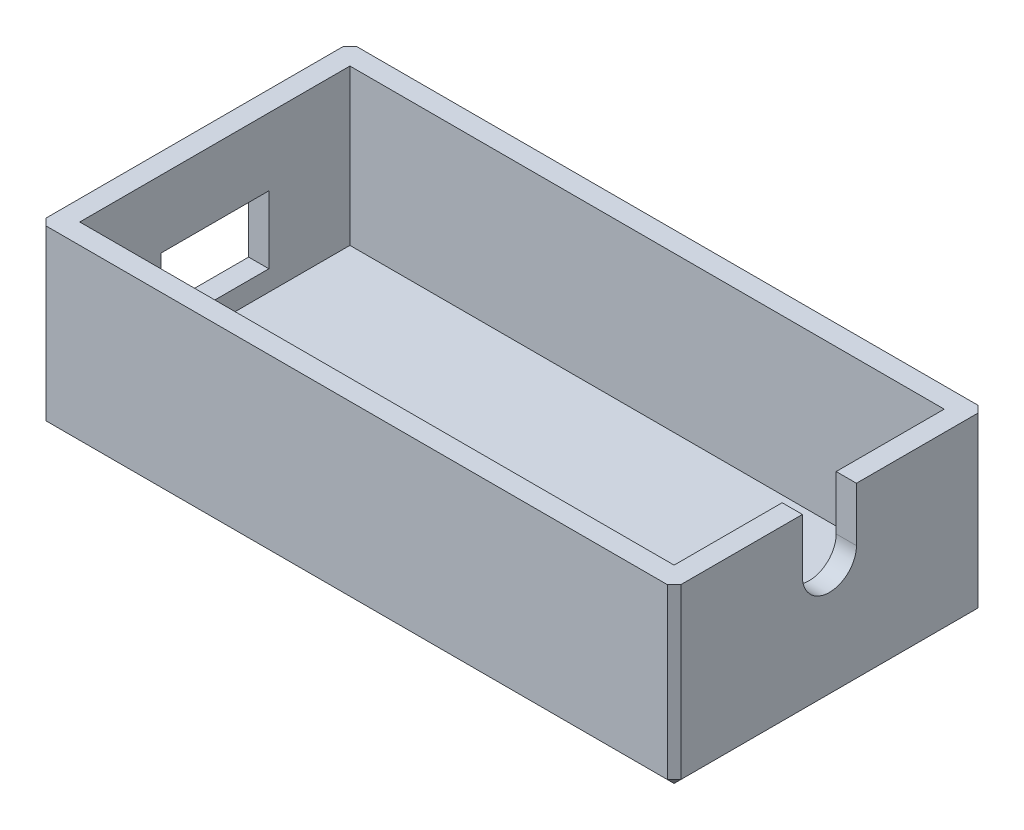
ISO-10303-21;
HEADER;
FILE_DESCRIPTION(('STEP AP214'),'2;1');
FILE_NAME('part.step','',(''),(''),'','','');
FILE_SCHEMA(('AUTOMOTIVE_DESIGN { 1 0 10303 214 1 1 1 1 }'));
ENDSEC;
DATA;
#1=APPLICATION_CONTEXT('core data for automotive mechanical design processes');
#2=APPLICATION_PROTOCOL_DEFINITION('international standard','automotive_design',2000,#1);
#3=PRODUCT_CONTEXT('',#1,'mechanical');
#4=PRODUCT('Part','Part','',(#3));
#5=PRODUCT_RELATED_PRODUCT_CATEGORY('part','',(#4));
#6=PRODUCT_DEFINITION_FORMATION('','',#4);
#7=PRODUCT_DEFINITION_CONTEXT('part definition',#1,'design');
#8=PRODUCT_DEFINITION('design','',#6,#7);
#9=PRODUCT_DEFINITION_SHAPE('','',#8);
#10=(LENGTH_UNIT() NAMED_UNIT(*) SI_UNIT(.MILLI.,.METRE.));
#11=(NAMED_UNIT(*) PLANE_ANGLE_UNIT() SI_UNIT($,.RADIAN.));
#12=(NAMED_UNIT(*) SI_UNIT($,.STERADIAN.) SOLID_ANGLE_UNIT());
#13=UNCERTAINTY_MEASURE_WITH_UNIT(LENGTH_MEASURE(1.E-05),#10,'distance_accuracy_value','');
#14=(GEOMETRIC_REPRESENTATION_CONTEXT(3) GLOBAL_UNCERTAINTY_ASSIGNED_CONTEXT((#13)) GLOBAL_UNIT_ASSIGNED_CONTEXT((#10,
#11,#12)) REPRESENTATION_CONTEXT('',''));
#15=CARTESIAN_POINT('',(0.,0.,0.));
#16=DIRECTION('',(0.,0.,1.));
#17=DIRECTION('',(1.,0.,0.));
#18=AXIS2_PLACEMENT_3D('',#15,#16,#17);
#19=CARTESIAN_POINT('',(24.,13.,0.));
#20=DIRECTION('',(1.,0.,0.));
#21=DIRECTION('',(0.,0.,-1.));
#22=AXIS2_PLACEMENT_3D('',#19,#20,#21);
#23=PLANE('',#22);
#24=DIRECTION('',(0.,0.,1.));
#25=VECTOR('',#24,1.);
#26=CARTESIAN_POINT('',(24.,13.,0.));
#27=LINE('',#26,#25);
#28=CARTESIAN_POINT('',(24.,13.,5.2911227154047));
#29=VERTEX_POINT('',#28);
#30=CARTESIAN_POINT('',(24.,13.,14.2911227154047));
#31=VERTEX_POINT('',#30);
#32=EDGE_CURVE('E215',#29,#31,#27,.T.);
#33=ORIENTED_EDGE('',*,*,#32,.T.);
#34=DIRECTION('',(0.,-1.,0.));
#35=VECTOR('',#34,1.);
#36=CARTESIAN_POINT('',(24.,0.,14.2911227154047));
#37=LINE('',#36,#35);
#38=CARTESIAN_POINT('',(24.,0.5,14.2911227154047));
#39=VERTEX_POINT('',#38);
#40=EDGE_CURVE('E311',#31,#39,#37,.T.);
#41=ORIENTED_EDGE('',*,*,#40,.T.);
#42=DIRECTION('',(0.,0.,-1.));
#43=VECTOR('',#42,1.);
#44=CARTESIAN_POINT('',(24.,0.5,-8.2088772845953));
#45=LINE('',#44,#43);
#46=CARTESIAN_POINT('',(24.,0.5,-7.7088772845953));
#47=VERTEX_POINT('',#46);
#48=EDGE_CURVE('E305',#39,#47,#45,.T.);
#49=ORIENTED_EDGE('',*,*,#48,.T.);
#50=DIRECTION('',(0.,1.,0.));
#51=VECTOR('',#50,1.);
#52=CARTESIAN_POINT('',(24.,13.,-7.7088772845953));
#53=LINE('',#52,#51);
#54=CARTESIAN_POINT('',(24.,13.,-7.7088772845953));
#55=VERTEX_POINT('',#54);
#56=EDGE_CURVE('E308',#47,#55,#53,.T.);
#57=ORIENTED_EDGE('',*,*,#56,.T.);
#58=CARTESIAN_POINT('',(24.,13.,1.2911227154047));
#59=VERTEX_POINT('',#58);
#60=EDGE_CURVE('E250',#55,#59,#27,.T.);
#61=ORIENTED_EDGE('',*,*,#60,.T.);
#62=DIRECTION('',(0.,1.,0.));
#63=VECTOR('',#62,1.);
#64=CARTESIAN_POINT('',(24.,13.,1.2911227154047));
#65=LINE('',#64,#63);
#66=CARTESIAN_POINT('',(24.,9.,1.2911227154047));
#67=VERTEX_POINT('',#66);
#68=EDGE_CURVE('E387',#67,#59,#65,.T.);
#69=ORIENTED_EDGE('',*,*,#68,.F.);
#70=CARTESIAN_POINT('',(24.,9.,3.2911227154047));
#71=DIRECTION('',(1.,0.,0.));
#72=DIRECTION('',(0.,0.,-1.));
#73=AXIS2_PLACEMENT_3D('',#70,#71,#72);
#74=CIRCLE('',#73,2.);
#75=CARTESIAN_POINT('',(24.,9.,5.2911227154047));
#76=VERTEX_POINT('',#75);
#77=EDGE_CURVE('E391',#76,#67,#74,.T.);
#78=ORIENTED_EDGE('',*,*,#77,.F.);
#79=DIRECTION('',(0.,1.,0.));
#80=VECTOR('',#79,1.);
#81=CARTESIAN_POINT('',(24.,13.,5.2911227154047));
#82=LINE('',#81,#80);
#83=EDGE_CURVE('E380',#76,#29,#82,.T.);
#84=ORIENTED_EDGE('',*,*,#83,.T.);
#85=EDGE_LOOP('',(#33,#41,#49,#57,#61,#69,#78,#84));
#86=FACE_BOUND('',#85,.T.);
#87=ADVANCED_FACE('F43',(#86),#23,.T.);
#88=CARTESIAN_POINT('',(0.,13.,-8.2088772845953));
#89=DIRECTION('',(0.,0.,-1.));
#90=DIRECTION('',(-1.,0.,0.));
#91=AXIS2_PLACEMENT_3D('',#88,#89,#90);
#92=PLANE('',#91);
#93=DIRECTION('',(-1.,0.,0.));
#94=VECTOR('',#93,1.);
#95=CARTESIAN_POINT('',(-23.,0.5,-8.2088772845953));
#96=LINE('',#95,#94);
#97=CARTESIAN_POINT('',(23.5,0.5,-8.2088772845953));
#98=VERTEX_POINT('',#97);
#99=CARTESIAN_POINT('',(-22.5,0.5,-8.2088772845953));
#100=VERTEX_POINT('',#99);
#101=EDGE_CURVE('E275',#98,#100,#96,.T.);
#102=ORIENTED_EDGE('',*,*,#101,.T.);
#103=DIRECTION('',(0.,1.,0.));
#104=VECTOR('',#103,1.);
#105=CARTESIAN_POINT('',(-22.5,13.,-8.2088772845953));
#106=LINE('',#105,#104);
#107=CARTESIAN_POINT('',(-22.5,13.,-8.2088772845953));
#108=VERTEX_POINT('',#107);
#109=EDGE_CURVE('E281',#100,#108,#106,.T.);
#110=ORIENTED_EDGE('',*,*,#109,.T.);
#111=DIRECTION('',(1.,0.,0.));
#112=VECTOR('',#111,1.);
#113=CARTESIAN_POINT('',(0.,13.,-8.2088772845953));
#114=LINE('',#113,#112);
#115=CARTESIAN_POINT('',(23.5,13.,-8.2088772845953));
#116=VERTEX_POINT('',#115);
#117=EDGE_CURVE('E253',#108,#116,#114,.T.);
#118=ORIENTED_EDGE('',*,*,#117,.T.);
#119=DIRECTION('',(0.,-1.,0.));
#120=VECTOR('',#119,1.);
#121=CARTESIAN_POINT('',(23.5,13.,-8.2088772845953));
#122=LINE('',#121,#120);
#123=EDGE_CURVE('E278',#116,#98,#122,.T.);
#124=ORIENTED_EDGE('',*,*,#123,.T.);
#125=EDGE_LOOP('',(#102,#110,#118,#124));
#126=FACE_BOUND('',#125,.T.);
#127=ADVANCED_FACE('F484',(#126),#92,.T.);
#128=CARTESIAN_POINT('',(-23.,13.,0.));
#129=DIRECTION('',(1.,0.,0.));
#130=DIRECTION('',(0.,0.,-1.));
#131=AXIS2_PLACEMENT_3D('',#128,#129,#130);
#132=PLANE('',#131);
#133=DIRECTION('',(0.,0.,1.));
#134=VECTOR('',#133,1.);
#135=CARTESIAN_POINT('',(-23.,13.,0.));
#136=LINE('',#135,#134);
#137=CARTESIAN_POINT('',(-23.,13.,-7.7088772845953));
#138=VERTEX_POINT('',#137);
#139=CARTESIAN_POINT('',(-23.,13.,14.2911227154047));
#140=VERTEX_POINT('',#139);
#141=EDGE_CURVE('E257',#138,#140,#136,.T.);
#142=ORIENTED_EDGE('',*,*,#141,.F.);
#143=DIRECTION('',(0.,-1.,0.));
#144=VECTOR('',#143,1.);
#145=CARTESIAN_POINT('',(-23.,0.,-7.7088772845953));
#146=LINE('',#145,#144);
#147=CARTESIAN_POINT('',(-23.,0.5,-7.7088772845953));
#148=VERTEX_POINT('',#147);
#149=EDGE_CURVE('E271',#138,#148,#146,.T.);
#150=ORIENTED_EDGE('',*,*,#149,.T.);
#151=DIRECTION('',(0.,0.,1.));
#152=VECTOR('',#151,1.);
#153=CARTESIAN_POINT('',(-23.,0.5,0.));
#154=LINE('',#153,#152);
#155=CARTESIAN_POINT('',(-23.,0.5,14.2911227154047));
#156=VERTEX_POINT('',#155);
#157=EDGE_CURVE('E265',#148,#156,#154,.T.);
#158=ORIENTED_EDGE('',*,*,#157,.T.);
#159=DIRECTION('',(0.,1.,0.));
#160=VECTOR('',#159,1.);
#161=CARTESIAN_POINT('',(-23.,13.,14.2911227154047));
#162=LINE('',#161,#160);
#163=EDGE_CURVE('E268',#156,#140,#162,.T.);
#164=ORIENTED_EDGE('',*,*,#163,.T.);
#165=EDGE_LOOP('',(#142,#150,#158,#164));
#166=FACE_BOUND('',#165,.T.);
#167=DIRECTION('',(0.,0.,1.));
#168=VECTOR('',#167,1.);
#169=CARTESIAN_POINT('',(-23.,8.,0.));
#170=LINE('',#169,#168);
#171=CARTESIAN_POINT('',(-23.,8.,-0.708877284595296));
#172=VERTEX_POINT('',#171);
#173=CARTESIAN_POINT('',(-23.,8.,7.2911227154047));
#174=VERTEX_POINT('',#173);
#175=EDGE_CURVE('E430',#172,#174,#170,.T.);
#176=ORIENTED_EDGE('',*,*,#175,.T.);
#177=DIRECTION('',(0.,-1.,0.));
#178=VECTOR('',#177,1.);
#179=CARTESIAN_POINT('',(-23.,13.,7.2911227154047));
#180=LINE('',#179,#178);
#181=CARTESIAN_POINT('',(-23.,3.,7.2911227154047));
#182=VERTEX_POINT('',#181);
#183=EDGE_CURVE('E434',#174,#182,#180,.T.);
#184=ORIENTED_EDGE('',*,*,#183,.T.);
#185=DIRECTION('',(0.,0.,-1.));
#186=VECTOR('',#185,1.);
#187=CARTESIAN_POINT('',(-23.,3.,0.));
#188=LINE('',#187,#186);
#189=CARTESIAN_POINT('',(-23.,3.,-0.708877284595297));
#190=VERTEX_POINT('',#189);
#191=EDGE_CURVE('E413',#182,#190,#188,.T.);
#192=ORIENTED_EDGE('',*,*,#191,.T.);
#193=DIRECTION('',(0.,1.,0.));
#194=VECTOR('',#193,1.);
#195=CARTESIAN_POINT('',(-23.,13.,-0.708877284595295));
#196=LINE('',#195,#194);
#197=EDGE_CURVE('E426',#190,#172,#196,.T.);
#198=ORIENTED_EDGE('',*,*,#197,.T.);
#199=EDGE_LOOP('',(#176,#184,#192,#198));
#200=FACE_BOUND('',#199,.T.);
#201=ADVANCED_FACE('F490',(#166,#200),#132,.F.);
#202=CARTESIAN_POINT('',(0.,13.,14.7911227154047));
#203=DIRECTION('',(0.,0.,-1.));
#204=DIRECTION('',(-1.,0.,0.));
#205=AXIS2_PLACEMENT_3D('',#202,#203,#204);
#206=PLANE('',#205);
#207=DIRECTION('',(1.,0.,0.));
#208=VECTOR('',#207,1.);
#209=CARTESIAN_POINT('',(0.,13.,14.7911227154047));
#210=LINE('',#209,#208);
#211=CARTESIAN_POINT('',(-22.5,13.,14.7911227154047));
#212=VERTEX_POINT('',#211);
#213=CARTESIAN_POINT('',(23.5,13.,14.7911227154047));
#214=VERTEX_POINT('',#213);
#215=EDGE_CURVE('E261',#212,#214,#210,.T.);
#216=ORIENTED_EDGE('',*,*,#215,.F.);
#217=DIRECTION('',(0.,-1.,0.));
#218=VECTOR('',#217,1.);
#219=CARTESIAN_POINT('',(-22.5,13.,14.7911227154047));
#220=LINE('',#219,#218);
#221=CARTESIAN_POINT('',(-22.5,0.5,14.7911227154047));
#222=VERTEX_POINT('',#221);
#223=EDGE_CURVE('E302',#212,#222,#220,.T.);
#224=ORIENTED_EDGE('',*,*,#223,.T.);
#225=DIRECTION('',(1.,0.,0.));
#226=VECTOR('',#225,1.);
#227=CARTESIAN_POINT('',(0.,0.5,14.7911227154047));
#228=LINE('',#227,#226);
#229=CARTESIAN_POINT('',(23.5,0.5,14.7911227154047));
#230=VERTEX_POINT('',#229);
#231=EDGE_CURVE('E296',#222,#230,#228,.T.);
#232=ORIENTED_EDGE('',*,*,#231,.T.);
#233=DIRECTION('',(0.,1.,0.));
#234=VECTOR('',#233,1.);
#235=CARTESIAN_POINT('',(23.5,13.,14.7911227154047));
#236=LINE('',#235,#234);
#237=EDGE_CURVE('E299',#230,#214,#236,.T.);
#238=ORIENTED_EDGE('',*,*,#237,.T.);
#239=EDGE_LOOP('',(#216,#224,#232,#238));
#240=FACE_BOUND('',#239,.T.);
#241=ADVANCED_FACE('F599',(#240),#206,.F.);
#242=CARTESIAN_POINT('',(0.,13.,0.));
#243=DIRECTION('',(0.,1.,0.));
#244=DIRECTION('',(0.,0.,1.));
#245=AXIS2_PLACEMENT_3D('',#242,#243,#244);
#246=PLANE('',#245);
#247=ORIENTED_EDGE('',*,*,#117,.F.);
#248=DIRECTION('',(-0.70710678118655,0.,0.707106781186545));
#249=VECTOR('',#248,1.);
#250=CARTESIAN_POINT('',(-15.3544386422976,13.,-15.3544386422977));
#251=LINE('',#250,#249);
#252=EDGE_CURVE('E293',#108,#138,#251,.T.);
#253=ORIENTED_EDGE('',*,*,#252,.T.);
#254=ORIENTED_EDGE('',*,*,#141,.T.);
#255=DIRECTION('',(-0.70710678118655,0.,-0.707106781186545));
#256=VECTOR('',#255,1.);
#257=CARTESIAN_POINT('',(-18.6455613577023,13.,18.6455613577024));
#258=LINE('',#257,#256);
#259=EDGE_CURVE('E290',#140,#212,#258,.F.);
#260=ORIENTED_EDGE('',*,*,#259,.T.);
#261=ORIENTED_EDGE('',*,*,#215,.T.);
#262=DIRECTION('',(0.707106781186548,0.,-0.707106781186548));
#263=VECTOR('',#262,1.);
#264=CARTESIAN_POINT('',(19.1455613577024,13.,19.1455613577024));
#265=LINE('',#264,#263);
#266=EDGE_CURVE('E287',#214,#31,#265,.T.);
#267=ORIENTED_EDGE('',*,*,#266,.T.);
#268=ORIENTED_EDGE('',*,*,#32,.F.);
#269=DIRECTION('',(-1.,0.,0.));
#270=VECTOR('',#269,1.);
#271=CARTESIAN_POINT('',(34.,13.,5.2911227154047));
#272=LINE('',#271,#270);
#273=CARTESIAN_POINT('',(22.5,13.,5.2911227154047));
#274=VERTEX_POINT('',#273);
#275=EDGE_CURVE('E196',#29,#274,#272,.T.);
#276=ORIENTED_EDGE('',*,*,#275,.T.);
#277=DIRECTION('',(0.,0.,-1.));
#278=VECTOR('',#277,1.);
#279=CARTESIAN_POINT('',(22.5,13.,-6.7088772845953));
#280=LINE('',#279,#278);
#281=CARTESIAN_POINT('',(22.5,13.,13.2911227154047));
#282=VERTEX_POINT('',#281);
#283=EDGE_CURVE('E213',#282,#274,#280,.T.);
#284=ORIENTED_EDGE('',*,*,#283,.F.);
#285=DIRECTION('',(1.,0.,0.));
#286=VECTOR('',#285,1.);
#287=CARTESIAN_POINT('',(-21.5,13.,13.2911227154047));
#288=LINE('',#287,#286);
#289=CARTESIAN_POINT('',(-21.5,13.,13.2911227154047));
#290=VERTEX_POINT('',#289);
#291=EDGE_CURVE('E232',#290,#282,#288,.T.);
#292=ORIENTED_EDGE('',*,*,#291,.F.);
#293=DIRECTION('',(0.,0.,1.));
#294=VECTOR('',#293,1.);
#295=CARTESIAN_POINT('',(-21.5,13.,-6.7088772845953));
#296=LINE('',#295,#294);
#297=CARTESIAN_POINT('',(-21.5,13.,-6.7088772845953));
#298=VERTEX_POINT('',#297);
#299=EDGE_CURVE('E438',#298,#290,#296,.T.);
#300=ORIENTED_EDGE('',*,*,#299,.F.);
#301=DIRECTION('',(-1.,0.,0.));
#302=VECTOR('',#301,1.);
#303=CARTESIAN_POINT('',(-21.5,13.,-6.7088772845953));
#304=LINE('',#303,#302);
#305=CARTESIAN_POINT('',(22.5,13.,-6.7088772845953));
#306=VERTEX_POINT('',#305);
#307=EDGE_CURVE('E224',#306,#298,#304,.T.);
#308=ORIENTED_EDGE('',*,*,#307,.F.);
#309=CARTESIAN_POINT('',(22.5,13.,1.2911227154047));
#310=VERTEX_POINT('',#309);
#311=EDGE_CURVE('E225',#310,#306,#280,.T.);
#312=ORIENTED_EDGE('',*,*,#311,.F.);
#313=DIRECTION('',(-1.,0.,0.));
#314=VECTOR('',#313,1.);
#315=CARTESIAN_POINT('',(34.,13.,1.2911227154047));
#316=LINE('',#315,#314);
#317=EDGE_CURVE('E217',#59,#310,#316,.T.);
#318=ORIENTED_EDGE('',*,*,#317,.F.);
#319=ORIENTED_EDGE('',*,*,#60,.F.);
#320=DIRECTION('',(0.707106781186548,0.,0.707106781186548));
#321=VECTOR('',#320,1.);
#322=CARTESIAN_POINT('',(15.8544386422977,13.,-15.8544386422977));
#323=LINE('',#322,#321);
#324=EDGE_CURVE('E284',#55,#116,#323,.F.);
#325=ORIENTED_EDGE('',*,*,#324,.T.);
#326=EDGE_LOOP('',(#247,#253,#254,#260,#261,#267,#268,#276,#284,#292,#300,#308,#312,#318,#319,#325));
#327=FACE_BOUND('',#326,.T.);
#328=ADVANCED_FACE('F211',(#327),#246,.T.);
#329=CARTESIAN_POINT('',(0.,0.,0.));
#330=DIRECTION('',(0.,1.,0.));
#331=DIRECTION('',(0.,0.,1.));
#332=AXIS2_PLACEMENT_3D('',#329,#330,#331);
#333=PLANE('',#332);
#334=DIRECTION('',(1.,0.,0.));
#335=VECTOR('',#334,1.);
#336=CARTESIAN_POINT('',(24.,0.,-7.7088772845953));
#337=LINE('',#336,#335);
#338=CARTESIAN_POINT('',(-22.5,0.,-7.7088772845953));
#339=VERTEX_POINT('',#338);
#340=CARTESIAN_POINT('',(23.5,0.,-7.7088772845953));
#341=VERTEX_POINT('',#340);
#342=EDGE_CURVE('E54',#339,#341,#337,.T.);
#343=ORIENTED_EDGE('',*,*,#342,.T.);
#344=DIRECTION('',(0.,0.,1.));
#345=VECTOR('',#344,1.);
#346=CARTESIAN_POINT('',(23.5,0.,14.7911227154047));
#347=LINE('',#346,#345);
#348=CARTESIAN_POINT('',(23.5,0.,14.2911227154047));
#349=VERTEX_POINT('',#348);
#350=EDGE_CURVE('E11',#341,#349,#347,.T.);
#351=ORIENTED_EDGE('',*,*,#350,.T.);
#352=DIRECTION('',(-1.,0.,0.));
#353=VECTOR('',#352,1.);
#354=CARTESIAN_POINT('',(0.,0.,14.2911227154047));
#355=LINE('',#354,#353);
#356=CARTESIAN_POINT('',(-22.5,0.,14.2911227154047));
#357=VERTEX_POINT('',#356);
#358=EDGE_CURVE('E314',#349,#357,#355,.T.);
#359=ORIENTED_EDGE('',*,*,#358,.T.);
#360=DIRECTION('',(0.,0.,-1.));
#361=VECTOR('',#360,1.);
#362=CARTESIAN_POINT('',(-22.5,0.,0.));
#363=LINE('',#362,#361);
#364=EDGE_CURVE('E65',#357,#339,#363,.T.);
#365=ORIENTED_EDGE('',*,*,#364,.T.);
#366=EDGE_LOOP('',(#343,#351,#359,#365));
#367=FACE_BOUND('',#366,.T.);
#368=ADVANCED_FACE('F471',(#367),#333,.F.);
#369=CARTESIAN_POINT('',(-21.5,1.5,-6.7088772845953));
#370=DIRECTION('',(-1.,0.,0.));
#371=DIRECTION('',(0.,0.,1.));
#372=AXIS2_PLACEMENT_3D('',#369,#370,#371);
#373=PLANE('',#372);
#374=DIRECTION('',(0.,0.,-1.));
#375=VECTOR('',#374,1.);
#376=CARTESIAN_POINT('',(-21.5,3.,7.2911227154047));
#377=LINE('',#376,#375);
#378=CARTESIAN_POINT('',(-21.5,3.,7.2911227154047));
#379=VERTEX_POINT('',#378);
#380=CARTESIAN_POINT('',(-21.5,3.,-0.708877284595297));
#381=VERTEX_POINT('',#380);
#382=EDGE_CURVE('E397',#379,#381,#377,.T.);
#383=ORIENTED_EDGE('',*,*,#382,.F.);
#384=DIRECTION('',(0.,-1.,0.));
#385=VECTOR('',#384,1.);
#386=CARTESIAN_POINT('',(-21.5,8.,7.2911227154047));
#387=LINE('',#386,#385);
#388=CARTESIAN_POINT('',(-21.5,8.,7.2911227154047));
#389=VERTEX_POINT('',#388);
#390=EDGE_CURVE('E394',#389,#379,#387,.T.);
#391=ORIENTED_EDGE('',*,*,#390,.F.);
#392=DIRECTION('',(0.,0.,1.));
#393=VECTOR('',#392,1.);
#394=CARTESIAN_POINT('',(-21.5,8.,7.2911227154047));
#395=LINE('',#394,#393);
#396=CARTESIAN_POINT('',(-21.5,8.,-0.708877284595296));
#397=VERTEX_POINT('',#396);
#398=EDGE_CURVE('E405',#397,#389,#395,.T.);
#399=ORIENTED_EDGE('',*,*,#398,.F.);
#400=DIRECTION('',(0.,1.,0.));
#401=VECTOR('',#400,1.);
#402=CARTESIAN_POINT('',(-21.5,8.,-0.708877284595296));
#403=LINE('',#402,#401);
#404=EDGE_CURVE('E401',#381,#397,#403,.T.);
#405=ORIENTED_EDGE('',*,*,#404,.F.);
#406=EDGE_LOOP('',(#383,#391,#399,#405));
#407=FACE_BOUND('',#406,.T.);
#408=ORIENTED_EDGE('',*,*,#299,.T.);
#409=DIRECTION('',(0.,1.,0.));
#410=VECTOR('',#409,1.);
#411=CARTESIAN_POINT('',(-21.5,1.5,13.2911227154047));
#412=LINE('',#411,#410);
#413=CARTESIAN_POINT('',(-21.5,1.5,13.2911227154047));
#414=VERTEX_POINT('',#413);
#415=EDGE_CURVE('E245',#414,#290,#412,.T.);
#416=ORIENTED_EDGE('',*,*,#415,.F.);
#417=DIRECTION('',(0.,0.,1.));
#418=VECTOR('',#417,1.);
#419=CARTESIAN_POINT('',(-21.5,1.5,-6.7088772845953));
#420=LINE('',#419,#418);
#421=CARTESIAN_POINT('',(-21.5,1.5,-6.7088772845953));
#422=VERTEX_POINT('',#421);
#423=EDGE_CURVE('E230',#422,#414,#420,.T.);
#424=ORIENTED_EDGE('',*,*,#423,.F.);
#425=DIRECTION('',(0.,1.,0.));
#426=VECTOR('',#425,1.);
#427=CARTESIAN_POINT('',(-21.5,1.5,-6.7088772845953));
#428=LINE('',#427,#426);
#429=EDGE_CURVE('E236',#422,#298,#428,.T.);
#430=ORIENTED_EDGE('',*,*,#429,.T.);
#431=EDGE_LOOP('',(#408,#416,#424,#430));
#432=FACE_BOUND('',#431,.T.);
#433=ADVANCED_FACE('F469',(#407,#432),#373,.F.);
#434=CARTESIAN_POINT('',(-21.5,1.5,-6.7088772845953));
#435=DIRECTION('',(0.,0.,-1.));
#436=DIRECTION('',(-1.,0.,0.));
#437=AXIS2_PLACEMENT_3D('',#434,#435,#436);
#438=PLANE('',#437);
#439=ORIENTED_EDGE('',*,*,#307,.T.);
#440=ORIENTED_EDGE('',*,*,#429,.F.);
#441=DIRECTION('',(-1.,0.,0.));
#442=VECTOR('',#441,1.);
#443=CARTESIAN_POINT('',(-21.5,1.5,-6.7088772845953));
#444=LINE('',#443,#442);
#445=CARTESIAN_POINT('',(22.5,1.5,-6.7088772845953));
#446=VERTEX_POINT('',#445);
#447=EDGE_CURVE('E249',#446,#422,#444,.T.);
#448=ORIENTED_EDGE('',*,*,#447,.F.);
#449=DIRECTION('',(0.,1.,0.));
#450=VECTOR('',#449,1.);
#451=CARTESIAN_POINT('',(22.5,1.5,-6.7088772845953));
#452=LINE('',#451,#450);
#453=EDGE_CURVE('E239',#446,#306,#452,.T.);
#454=ORIENTED_EDGE('',*,*,#453,.T.);
#455=EDGE_LOOP('',(#439,#440,#448,#454));
#456=FACE_BOUND('',#455,.T.);
#457=ADVANCED_FACE('F463',(#456),#438,.F.);
#458=CARTESIAN_POINT('',(22.5,1.5,-6.7088772845953));
#459=DIRECTION('',(1.,0.,0.));
#460=DIRECTION('',(0.,0.,-1.));
#461=AXIS2_PLACEMENT_3D('',#458,#459,#460);
#462=PLANE('',#461);
#463=CARTESIAN_POINT('',(22.5,9.,3.2911227154047));
#464=DIRECTION('',(-1.,0.,0.));
#465=DIRECTION('',(0.,0.,1.));
#466=AXIS2_PLACEMENT_3D('',#463,#464,#465);
#467=CIRCLE('',#466,2.);
#468=CARTESIAN_POINT('',(22.5,9.,1.2911227154047));
#469=VERTEX_POINT('',#468);
#470=CARTESIAN_POINT('',(22.5,9.,5.2911227154047));
#471=VERTEX_POINT('',#470);
#472=EDGE_CURVE('E205',#469,#471,#467,.T.);
#473=ORIENTED_EDGE('',*,*,#472,.F.);
#474=DIRECTION('',(0.,-1.,0.));
#475=VECTOR('',#474,1.);
#476=CARTESIAN_POINT('',(22.5,0.,1.2911227154047));
#477=LINE('',#476,#475);
#478=EDGE_CURVE('E204',#310,#469,#477,.T.);
#479=ORIENTED_EDGE('',*,*,#478,.F.);
#480=ORIENTED_EDGE('',*,*,#311,.T.);
#481=ORIENTED_EDGE('',*,*,#453,.F.);
#482=DIRECTION('',(0.,0.,-1.));
#483=VECTOR('',#482,1.);
#484=CARTESIAN_POINT('',(22.5,1.5,-6.7088772845953));
#485=LINE('',#484,#483);
#486=CARTESIAN_POINT('',(22.5,1.5,13.2911227154047));
#487=VERTEX_POINT('',#486);
#488=EDGE_CURVE('E446',#487,#446,#485,.T.);
#489=ORIENTED_EDGE('',*,*,#488,.F.);
#490=DIRECTION('',(0.,1.,0.));
#491=VECTOR('',#490,1.);
#492=CARTESIAN_POINT('',(22.5,1.5,13.2911227154047));
#493=LINE('',#492,#491);
#494=EDGE_CURVE('E221',#487,#282,#493,.T.);
#495=ORIENTED_EDGE('',*,*,#494,.T.);
#496=ORIENTED_EDGE('',*,*,#283,.T.);
#497=DIRECTION('',(0.,-1.,0.));
#498=VECTOR('',#497,1.);
#499=CARTESIAN_POINT('',(22.5,0.,5.29112271540471));
#500=LINE('',#499,#498);
#501=EDGE_CURVE('E193',#274,#471,#500,.T.);
#502=ORIENTED_EDGE('',*,*,#501,.T.);
#503=EDGE_LOOP('',(#473,#479,#480,#481,#489,#495,#496,#502));
#504=FACE_BOUND('',#503,.T.);
#505=ADVANCED_FACE('F219',(#504),#462,.F.);
#506=CARTESIAN_POINT('',(-21.5,1.5,13.2911227154047));
#507=DIRECTION('',(0.,0.,1.));
#508=DIRECTION('',(1.,0.,0.));
#509=AXIS2_PLACEMENT_3D('',#506,#507,#508);
#510=PLANE('',#509);
#511=ORIENTED_EDGE('',*,*,#291,.T.);
#512=ORIENTED_EDGE('',*,*,#494,.F.);
#513=DIRECTION('',(1.,0.,0.));
#514=VECTOR('',#513,1.);
#515=CARTESIAN_POINT('',(-21.5,1.5,13.2911227154047));
#516=LINE('',#515,#514);
#517=EDGE_CURVE('E442',#414,#487,#516,.T.);
#518=ORIENTED_EDGE('',*,*,#517,.F.);
#519=ORIENTED_EDGE('',*,*,#415,.T.);
#520=EDGE_LOOP('',(#511,#512,#518,#519));
#521=FACE_BOUND('',#520,.T.);
#522=ADVANCED_FACE('F457',(#521),#510,.F.);
#523=CARTESIAN_POINT('',(0.,1.5,0.));
#524=DIRECTION('',(0.,1.,0.));
#525=DIRECTION('',(0.,0.,1.));
#526=AXIS2_PLACEMENT_3D('',#523,#524,#525);
#527=PLANE('',#526);
#528=ORIENTED_EDGE('',*,*,#423,.T.);
#529=ORIENTED_EDGE('',*,*,#517,.T.);
#530=ORIENTED_EDGE('',*,*,#488,.T.);
#531=ORIENTED_EDGE('',*,*,#447,.T.);
#532=EDGE_LOOP('',(#528,#529,#530,#531));
#533=FACE_BOUND('',#532,.T.);
#534=ADVANCED_FACE('F468',(#533),#527,.T.);
#535=CARTESIAN_POINT('',(-33.,8.,7.29112271540471));
#536=DIRECTION('',(0.,0.,1.));
#537=DIRECTION('',(1.,0.,0.));
#538=AXIS2_PLACEMENT_3D('',#535,#536,#537);
#539=PLANE('',#538);
#540=DIRECTION('',(1.,0.,0.));
#541=VECTOR('',#540,1.);
#542=CARTESIAN_POINT('',(-33.,8.,7.29112271540471));
#543=LINE('',#542,#541);
#544=EDGE_CURVE('E410',#174,#389,#543,.T.);
#545=ORIENTED_EDGE('',*,*,#544,.T.);
#546=ORIENTED_EDGE('',*,*,#390,.T.);
#547=DIRECTION('',(1.,0.,0.));
#548=VECTOR('',#547,1.);
#549=CARTESIAN_POINT('',(-33.,3.,7.2911227154047));
#550=LINE('',#549,#548);
#551=EDGE_CURVE('E409',#182,#379,#550,.T.);
#552=ORIENTED_EDGE('',*,*,#551,.F.);
#553=ORIENTED_EDGE('',*,*,#183,.F.);
#554=EDGE_LOOP('',(#545,#546,#552,#553));
#555=FACE_BOUND('',#554,.T.);
#556=ADVANCED_FACE('F624',(#555),#539,.F.);
#557=CARTESIAN_POINT('',(-33.,8.,7.29112271540471));
#558=DIRECTION('',(0.,1.,0.));
#559=DIRECTION('',(0.,0.,1.));
#560=AXIS2_PLACEMENT_3D('',#557,#558,#559);
#561=PLANE('',#560);
#562=DIRECTION('',(1.,0.,0.));
#563=VECTOR('',#562,1.);
#564=CARTESIAN_POINT('',(-33.,8.,-0.708877284595294));
#565=LINE('',#564,#563);
#566=EDGE_CURVE('E414',#172,#397,#565,.T.);
#567=ORIENTED_EDGE('',*,*,#566,.T.);
#568=ORIENTED_EDGE('',*,*,#398,.T.);
#569=ORIENTED_EDGE('',*,*,#544,.F.);
#570=ORIENTED_EDGE('',*,*,#175,.F.);
#571=EDGE_LOOP('',(#567,#568,#569,#570));
#572=FACE_BOUND('',#571,.T.);
#573=ADVANCED_FACE('F620',(#572),#561,.F.);
#574=CARTESIAN_POINT('',(-33.,8.,-0.708877284595294));
#575=DIRECTION('',(0.,0.,-1.));
#576=DIRECTION('',(-1.,0.,0.));
#577=AXIS2_PLACEMENT_3D('',#574,#575,#576);
#578=PLANE('',#577);
#579=DIRECTION('',(1.,0.,0.));
#580=VECTOR('',#579,1.);
#581=CARTESIAN_POINT('',(-33.,3.,-0.708877284595295));
#582=LINE('',#581,#580);
#583=EDGE_CURVE('E417',#190,#381,#582,.T.);
#584=ORIENTED_EDGE('',*,*,#583,.T.);
#585=ORIENTED_EDGE('',*,*,#404,.T.);
#586=ORIENTED_EDGE('',*,*,#566,.F.);
#587=ORIENTED_EDGE('',*,*,#197,.F.);
#588=EDGE_LOOP('',(#584,#585,#586,#587));
#589=FACE_BOUND('',#588,.T.);
#590=ADVANCED_FACE('F623',(#589),#578,.F.);
#591=CARTESIAN_POINT('',(-33.,3.,7.2911227154047));
#592=DIRECTION('',(0.,-1.,0.));
#593=DIRECTION('',(0.,0.,-1.));
#594=AXIS2_PLACEMENT_3D('',#591,#592,#593);
#595=PLANE('',#594);
#596=ORIENTED_EDGE('',*,*,#551,.T.);
#597=ORIENTED_EDGE('',*,*,#382,.T.);
#598=ORIENTED_EDGE('',*,*,#583,.F.);
#599=ORIENTED_EDGE('',*,*,#191,.F.);
#600=EDGE_LOOP('',(#596,#597,#598,#599));
#601=FACE_BOUND('',#600,.T.);
#602=ADVANCED_FACE('F617',(#601),#595,.F.);
#603=CARTESIAN_POINT('',(34.,9.,3.2911227154047));
#604=DIRECTION('',(-1.,0.,0.));
#605=DIRECTION('',(0.,0.,1.));
#606=AXIS2_PLACEMENT_3D('',#603,#604,#605);
#607=CYLINDRICAL_SURFACE('',#606,2.);
#608=ORIENTED_EDGE('',*,*,#77,.T.);
#609=DIRECTION('',(-1.,0.,0.));
#610=VECTOR('',#609,1.);
#611=CARTESIAN_POINT('',(34.,9.,1.2911227154047));
#612=LINE('',#611,#610);
#613=EDGE_CURVE('E377',#67,#469,#612,.T.);
#614=ORIENTED_EDGE('',*,*,#613,.T.);
#615=ORIENTED_EDGE('',*,*,#472,.T.);
#616=DIRECTION('',(-1.,0.,0.));
#617=VECTOR('',#616,1.);
#618=CARTESIAN_POINT('',(34.,9.,5.2911227154047));
#619=LINE('',#618,#617);
#620=EDGE_CURVE('E199',#76,#471,#619,.T.);
#621=ORIENTED_EDGE('',*,*,#620,.F.);
#622=EDGE_LOOP('',(#608,#614,#615,#621));
#623=FACE_BOUND('',#622,.T.);
#624=ADVANCED_FACE('F606',(#623),#607,.F.);
#625=CARTESIAN_POINT('',(34.,0.,1.2911227154047));
#626=DIRECTION('',(0.,0.,-1.));
#627=DIRECTION('',(0.,1.,0.));
#628=AXIS2_PLACEMENT_3D('',#625,#626,#627);
#629=PLANE('',#628);
#630=ORIENTED_EDGE('',*,*,#68,.T.);
#631=ORIENTED_EDGE('',*,*,#317,.T.);
#632=ORIENTED_EDGE('',*,*,#478,.T.);
#633=ORIENTED_EDGE('',*,*,#613,.F.);
#634=EDGE_LOOP('',(#630,#631,#632,#633));
#635=FACE_BOUND('',#634,.T.);
#636=ADVANCED_FACE('F609',(#635),#629,.F.);
#637=CARTESIAN_POINT('',(34.,0.,5.29112271540471));
#638=DIRECTION('',(0.,0.,-1.));
#639=DIRECTION('',(0.,1.,0.));
#640=AXIS2_PLACEMENT_3D('',#637,#638,#639);
#641=PLANE('',#640);
#642=ORIENTED_EDGE('',*,*,#620,.T.);
#643=ORIENTED_EDGE('',*,*,#501,.F.);
#644=ORIENTED_EDGE('',*,*,#275,.F.);
#645=ORIENTED_EDGE('',*,*,#83,.F.);
#646=EDGE_LOOP('',(#642,#643,#644,#645));
#647=FACE_BOUND('',#646,.T.);
#648=ADVANCED_FACE('F195',(#647),#641,.T.);
#649=CARTESIAN_POINT('',(24.,13.,14.2911227154047));
#650=DIRECTION('',(0.707106781186547,0.,0.707106781186547));
#651=DIRECTION('',(0.,1.,0.));
#652=AXIS2_PLACEMENT_3D('',#649,#650,#651);
#653=PLANE('',#652);
#654=DIRECTION('',(-0.707106781186548,0.,0.707106781186548));
#655=VECTOR('',#654,1.);
#656=CARTESIAN_POINT('',(24.,0.5,14.2911227154047));
#657=LINE('',#656,#655);
#658=EDGE_CURVE('E48',#39,#230,#657,.T.);
#659=ORIENTED_EDGE('',*,*,#658,.F.);
#660=ORIENTED_EDGE('',*,*,#40,.F.);
#661=ORIENTED_EDGE('',*,*,#266,.F.);
#662=ORIENTED_EDGE('',*,*,#237,.F.);
#663=EDGE_LOOP('',(#659,#660,#661,#662));
#664=FACE_BOUND('',#663,.T.);
#665=ADVANCED_FACE('F46',(#664),#653,.T.);
#666=CARTESIAN_POINT('',(24.,0.5,14.2911227154047));
#667=DIRECTION('',(0.577350269189625,-0.577350269189626,0.577350269189627));
#668=DIRECTION('',(0.,-0.707106781186548,-0.707106781186547));
#669=AXIS2_PLACEMENT_3D('',#666,#667,#668);
#670=PLANE('',#669);
#671=DIRECTION('',(0.707106781186547,0.707106781186547,0.));
#672=VECTOR('',#671,1.);
#673=CARTESIAN_POINT('',(24.,0.5,14.2911227154047));
#674=LINE('',#673,#672);
#675=EDGE_CURVE('E356',#39,#349,#674,.F.);
#676=ORIENTED_EDGE('',*,*,#675,.F.);
#677=ORIENTED_EDGE('',*,*,#658,.T.);
#678=DIRECTION('',(0.,0.707106781186548,0.707106781186548));
#679=VECTOR('',#678,1.);
#680=CARTESIAN_POINT('',(23.5,0.250000000000001,14.5411227154047));
#681=LINE('',#680,#679);
#682=EDGE_CURVE('E359',#349,#230,#681,.T.);
#683=ORIENTED_EDGE('',*,*,#682,.F.);
#684=EDGE_LOOP('',(#676,#677,#683));
#685=FACE_BOUND('',#684,.T.);
#686=ADVANCED_FACE('F563',(#685),#670,.T.);
#687=CARTESIAN_POINT('',(-22.5,13.,14.7911227154047));
#688=DIRECTION('',(0.707106781186545,0.,-0.70710678118655));
#689=DIRECTION('',(0.,-1.,0.));
#690=AXIS2_PLACEMENT_3D('',#687,#688,#689);
#691=PLANE('',#690);
#692=ORIENTED_EDGE('',*,*,#259,.F.);
#693=ORIENTED_EDGE('',*,*,#163,.F.);
#694=DIRECTION('',(0.70710678118655,0.,0.707106781186545));
#695=VECTOR('',#694,1.);
#696=CARTESIAN_POINT('',(-22.5,0.5,14.7911227154047));
#697=LINE('',#696,#695);
#698=EDGE_CURVE('E352',#222,#156,#697,.F.);
#699=ORIENTED_EDGE('',*,*,#698,.F.);
#700=ORIENTED_EDGE('',*,*,#223,.F.);
#701=EDGE_LOOP('',(#692,#693,#699,#700));
#702=FACE_BOUND('',#701,.T.);
#703=ADVANCED_FACE('F558',(#702),#691,.F.);
#704=CARTESIAN_POINT('',(0.,0.5,14.7911227154047));
#705=DIRECTION('',(0.,0.707106781186547,-0.707106781186547));
#706=DIRECTION('',(1.,0.,0.));
#707=AXIS2_PLACEMENT_3D('',#704,#705,#706);
#708=PLANE('',#707);
#709=ORIENTED_EDGE('',*,*,#682,.T.);
#710=ORIENTED_EDGE('',*,*,#231,.F.);
#711=DIRECTION('',(0.,-0.707106781186548,-0.707106781186548));
#712=VECTOR('',#711,1.);
#713=CARTESIAN_POINT('',(-22.5,0.5,14.7911227154047));
#714=LINE('',#713,#712);
#715=EDGE_CURVE('E348',#357,#222,#714,.F.);
#716=ORIENTED_EDGE('',*,*,#715,.F.);
#717=ORIENTED_EDGE('',*,*,#358,.F.);
#718=EDGE_LOOP('',(#709,#710,#716,#717));
#719=FACE_BOUND('',#718,.T.);
#720=ADVANCED_FACE('F551',(#719),#708,.F.);
#721=CARTESIAN_POINT('',(23.5,0.,0.));
#722=DIRECTION('',(0.707106781186547,-0.707106781186547,0.));
#723=DIRECTION('',(0.,0.,-1.));
#724=AXIS2_PLACEMENT_3D('',#721,#722,#723);
#725=PLANE('',#724);
#726=ORIENTED_EDGE('',*,*,#675,.T.);
#727=ORIENTED_EDGE('',*,*,#350,.F.);
#728=DIRECTION('',(-0.707106781186547,-0.707106781186547,0.));
#729=VECTOR('',#728,1.);
#730=CARTESIAN_POINT('',(23.75,0.250000000000001,-7.7088772845953));
#731=LINE('',#730,#729);
#732=EDGE_CURVE('E344',#47,#341,#731,.T.);
#733=ORIENTED_EDGE('',*,*,#732,.F.);
#734=ORIENTED_EDGE('',*,*,#48,.F.);
#735=EDGE_LOOP('',(#726,#727,#733,#734));
#736=FACE_BOUND('',#735,.T.);
#737=ADVANCED_FACE('F544',(#736),#725,.T.);
#738=CARTESIAN_POINT('',(23.5,13.,-8.2088772845953));
#739=DIRECTION('',(-0.707106781186547,0.,0.707106781186547));
#740=DIRECTION('',(0.,-1.,0.));
#741=AXIS2_PLACEMENT_3D('',#738,#739,#740);
#742=PLANE('',#741);
#743=ORIENTED_EDGE('',*,*,#324,.F.);
#744=ORIENTED_EDGE('',*,*,#56,.F.);
#745=DIRECTION('',(-0.707106781186548,0.,-0.707106781186548));
#746=VECTOR('',#745,1.);
#747=CARTESIAN_POINT('',(23.5,0.5,-8.2088772845953));
#748=LINE('',#747,#746);
#749=EDGE_CURVE('E340',#98,#47,#748,.F.);
#750=ORIENTED_EDGE('',*,*,#749,.F.);
#751=ORIENTED_EDGE('',*,*,#123,.F.);
#752=EDGE_LOOP('',(#743,#744,#750,#751));
#753=FACE_BOUND('',#752,.T.);
#754=ADVANCED_FACE('F537',(#753),#742,.F.);
#755=CARTESIAN_POINT('',(-22.5,0.5,14.7911227154047));
#756=DIRECTION('',(-0.577350269189626,-0.577350269189624,0.577350269189628));
#757=DIRECTION('',(0.707106781186549,0.,0.707106781186546));
#758=AXIS2_PLACEMENT_3D('',#755,#756,#757);
#759=PLANE('',#758);
#760=ORIENTED_EDGE('',*,*,#715,.T.);
#761=ORIENTED_EDGE('',*,*,#698,.T.);
#762=DIRECTION('',(-0.707106781186548,0.707106781186548,0.));
#763=VECTOR('',#762,1.);
#764=CARTESIAN_POINT('',(-22.75,0.249999999999997,14.2911227154047));
#765=LINE('',#764,#763);
#766=EDGE_CURVE('E336',#357,#156,#765,.T.);
#767=ORIENTED_EDGE('',*,*,#766,.F.);
#768=EDGE_LOOP('',(#760,#761,#767));
#769=FACE_BOUND('',#768,.T.);
#770=ADVANCED_FACE('F530',(#769),#759,.T.);
#771=CARTESIAN_POINT('',(23.5,0.5,-8.2088772845953));
#772=DIRECTION('',(0.577350269189625,-0.577350269189626,-0.577350269189626));
#773=DIRECTION('',(0.,0.707106781186547,-0.707106781186547));
#774=AXIS2_PLACEMENT_3D('',#771,#772,#773);
#775=PLANE('',#774);
#776=ORIENTED_EDGE('',*,*,#749,.T.);
#777=ORIENTED_EDGE('',*,*,#732,.T.);
#778=DIRECTION('',(0.,0.707106781186548,-0.707106781186548));
#779=VECTOR('',#778,1.);
#780=CARTESIAN_POINT('',(23.5,0.5,-8.2088772845953));
#781=LINE('',#780,#779);
#782=EDGE_CURVE('E332',#98,#341,#781,.F.);
#783=ORIENTED_EDGE('',*,*,#782,.F.);
#784=EDGE_LOOP('',(#776,#777,#783));
#785=FACE_BOUND('',#784,.T.);
#786=ADVANCED_FACE('F523',(#785),#775,.T.);
#787=CARTESIAN_POINT('',(-23.,0.5,0.));
#788=DIRECTION('',(0.707106781186547,0.707106781186547,0.));
#789=DIRECTION('',(0.,0.,1.));
#790=AXIS2_PLACEMENT_3D('',#787,#788,#789);
#791=PLANE('',#790);
#792=ORIENTED_EDGE('',*,*,#766,.T.);
#793=ORIENTED_EDGE('',*,*,#157,.F.);
#794=DIRECTION('',(0.707106781186548,-0.707106781186548,0.));
#795=VECTOR('',#794,1.);
#796=CARTESIAN_POINT('',(-23.,0.5,-7.7088772845953));
#797=LINE('',#796,#795);
#798=EDGE_CURVE('E328',#339,#148,#797,.F.);
#799=ORIENTED_EDGE('',*,*,#798,.F.);
#800=ORIENTED_EDGE('',*,*,#364,.F.);
#801=EDGE_LOOP('',(#792,#793,#799,#800));
#802=FACE_BOUND('',#801,.T.);
#803=ADVANCED_FACE('F516',(#802),#791,.F.);
#804=CARTESIAN_POINT('',(0.,0.,-7.7088772845953));
#805=DIRECTION('',(0.,-0.707106781186547,-0.707106781186547));
#806=DIRECTION('',(-1.,0.,0.));
#807=AXIS2_PLACEMENT_3D('',#804,#805,#806);
#808=PLANE('',#807);
#809=ORIENTED_EDGE('',*,*,#782,.T.);
#810=ORIENTED_EDGE('',*,*,#342,.F.);
#811=DIRECTION('',(0.,-0.707106781186548,0.707106781186548));
#812=VECTOR('',#811,1.);
#813=CARTESIAN_POINT('',(-22.5,0.249999999999998,-7.9588772845953));
#814=LINE('',#813,#812);
#815=EDGE_CURVE('E324',#100,#339,#814,.T.);
#816=ORIENTED_EDGE('',*,*,#815,.F.);
#817=ORIENTED_EDGE('',*,*,#101,.F.);
#818=EDGE_LOOP('',(#809,#810,#816,#817));
#819=FACE_BOUND('',#818,.T.);
#820=ADVANCED_FACE('F509',(#819),#808,.T.);
#821=CARTESIAN_POINT('',(-23.,0.5,-7.7088772845953));
#822=DIRECTION('',(-0.577350269189625,-0.577350269189624,-0.577350269189628));
#823=DIRECTION('',(-0.707106781186549,0.,0.707106781186546));
#824=AXIS2_PLACEMENT_3D('',#821,#822,#823);
#825=PLANE('',#824);
#826=ORIENTED_EDGE('',*,*,#815,.T.);
#827=ORIENTED_EDGE('',*,*,#798,.T.);
#828=DIRECTION('',(0.70710678118655,0.,-0.707106781186545));
#829=VECTOR('',#828,1.);
#830=CARTESIAN_POINT('',(-23.,0.5,-7.7088772845953));
#831=LINE('',#830,#829);
#832=EDGE_CURVE('E321',#100,#148,#831,.F.);
#833=ORIENTED_EDGE('',*,*,#832,.F.);
#834=EDGE_LOOP('',(#826,#827,#833));
#835=FACE_BOUND('',#834,.T.);
#836=ADVANCED_FACE('F502',(#835),#825,.T.);
#837=CARTESIAN_POINT('',(-23.,13.,-7.7088772845953));
#838=DIRECTION('',(-0.707106781186545,0.,-0.70710678118655));
#839=DIRECTION('',(0.,1.,0.));
#840=AXIS2_PLACEMENT_3D('',#837,#838,#839);
#841=PLANE('',#840);
#842=ORIENTED_EDGE('',*,*,#252,.F.);
#843=ORIENTED_EDGE('',*,*,#109,.F.);
#844=ORIENTED_EDGE('',*,*,#832,.T.);
#845=ORIENTED_EDGE('',*,*,#149,.F.);
#846=EDGE_LOOP('',(#842,#843,#844,#845));
#847=FACE_BOUND('',#846,.T.);
#848=ADVANCED_FACE('F496',(#847),#841,.T.);
#849=CLOSED_SHELL('',(#87,#127,#201,#241,#328,#368,#433,#457,#505,#522,#534,#556,#573,#590,#602,
#624,#636,#648,#665,#686,#703,#720,#737,#754,#770,#786,#803,#820,#836,#848));
#850=MANIFOLD_SOLID_BREP('B2',#849);
#851=ADVANCED_BREP_SHAPE_REPRESENTATION('',(#18,#850),#14);
#852=SHAPE_DEFINITION_REPRESENTATION(#9,#851);
ENDSEC;
END-ISO-10303-21;
